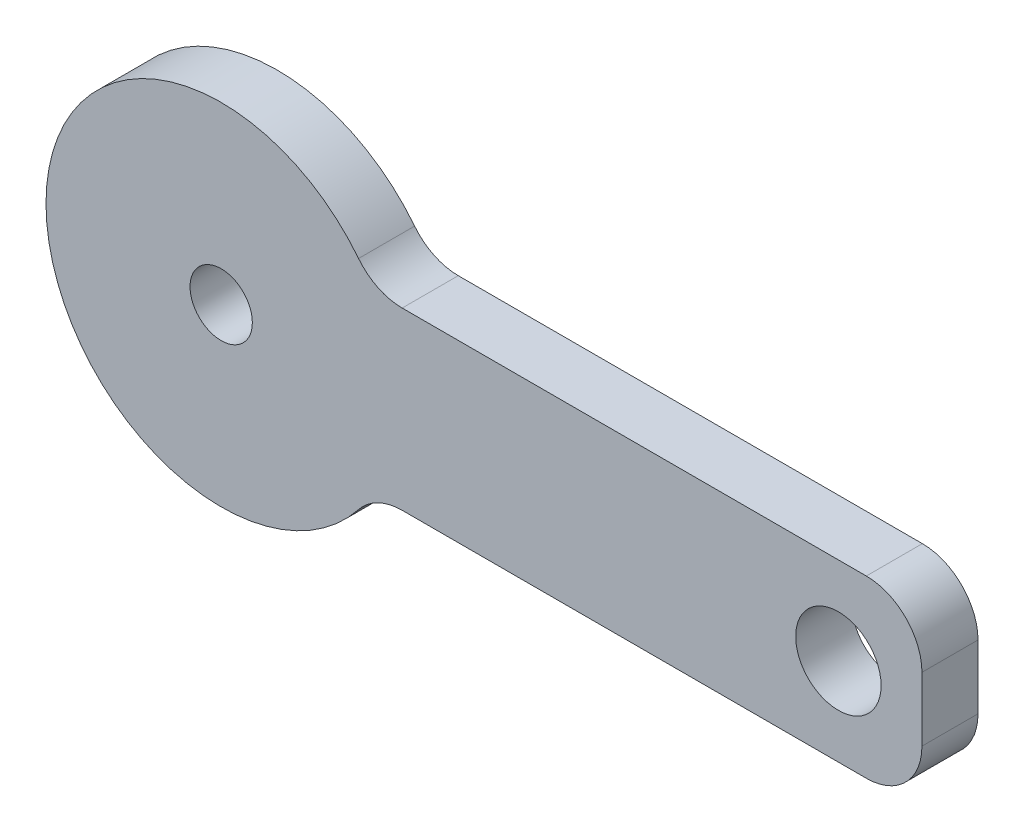
ISO-10303-21;
HEADER;
FILE_DESCRIPTION(('STEP AP214'),'2;1');
FILE_NAME('part.step','',(''),(''),'','','');
FILE_SCHEMA(('AUTOMOTIVE_DESIGN { 1 0 10303 214 1 1 1 1 }'));
ENDSEC;
DATA;
#1=APPLICATION_CONTEXT('core data for automotive mechanical design processes');
#2=APPLICATION_PROTOCOL_DEFINITION('international standard','automotive_design',2000,#1);
#3=PRODUCT_CONTEXT('',#1,'mechanical');
#4=PRODUCT('Part','Part','',(#3));
#5=PRODUCT_RELATED_PRODUCT_CATEGORY('part','',(#4));
#6=PRODUCT_DEFINITION_FORMATION('','',#4);
#7=PRODUCT_DEFINITION_CONTEXT('part definition',#1,'design');
#8=PRODUCT_DEFINITION('design','',#6,#7);
#9=PRODUCT_DEFINITION_SHAPE('','',#8);
#10=(LENGTH_UNIT() NAMED_UNIT(*) SI_UNIT(.MILLI.,.METRE.));
#11=(NAMED_UNIT(*) PLANE_ANGLE_UNIT() SI_UNIT($,.RADIAN.));
#12=(NAMED_UNIT(*) SI_UNIT($,.STERADIAN.) SOLID_ANGLE_UNIT());
#13=UNCERTAINTY_MEASURE_WITH_UNIT(LENGTH_MEASURE(1.E-05),#10,'distance_accuracy_value','');
#14=(GEOMETRIC_REPRESENTATION_CONTEXT(3) GLOBAL_UNCERTAINTY_ASSIGNED_CONTEXT((#13)) GLOBAL_UNIT_ASSIGNED_CONTEXT((#10,
#11,#12)) REPRESENTATION_CONTEXT('',''));
#15=CARTESIAN_POINT('',(0.,0.,0.));
#16=DIRECTION('',(0.,0.,1.));
#17=DIRECTION('',(1.,0.,0.));
#18=AXIS2_PLACEMENT_3D('',#15,#16,#17);
#19=CARTESIAN_POINT('',(5.16599457994296,-4.0875,1.6002));
#20=DIRECTION('',(0.,0.,-1.));
#21=DIRECTION('',(-1.,0.,0.));
#22=AXIS2_PLACEMENT_3D('',#19,#20,#21);
#23=CYLINDRICAL_SURFACE('',#22,1.5875);
#24=CARTESIAN_POINT('',(5.16599457994296,-4.0875,0.));
#25=DIRECTION('',(0.,0.,-1.));
#26=DIRECTION('',(1.,0.,0.));
#27=AXIS2_PLACEMENT_3D('',#24,#25,#26);
#28=CIRCLE('',#27,1.5875);
#29=CARTESIAN_POINT('',(3.92105850470053,-3.10246679316888,0.));
#30=VERTEX_POINT('',#29);
#31=CARTESIAN_POINT('',(5.16599457994296,-2.5,0.));
#32=VERTEX_POINT('',#31);
#33=EDGE_CURVE('E129',#30,#32,#28,.T.);
#34=ORIENTED_EDGE('',*,*,#33,.T.);
#35=DIRECTION('',(0.,0.,-1.));
#36=VECTOR('',#35,1.);
#37=CARTESIAN_POINT('',(5.16599457994296,-2.5,1.6002));
#38=LINE('',#37,#36);
#39=CARTESIAN_POINT('',(5.16599457994296,-2.5,1.6002));
#40=VERTEX_POINT('',#39);
#41=EDGE_CURVE('E11',#40,#32,#38,.T.);
#42=ORIENTED_EDGE('',*,*,#41,.F.);
#43=CARTESIAN_POINT('',(5.16599457994296,-4.0875,1.6002));
#44=DIRECTION('',(0.,0.,-1.));
#45=DIRECTION('',(1.,0.,0.));
#46=AXIS2_PLACEMENT_3D('',#43,#44,#45);
#47=CIRCLE('',#46,1.5875);
#48=CARTESIAN_POINT('',(3.92105850470053,-3.10246679316888,1.6002));
#49=VERTEX_POINT('',#48);
#50=EDGE_CURVE('E144',#49,#40,#47,.T.);
#51=ORIENTED_EDGE('',*,*,#50,.F.);
#52=DIRECTION('',(0.,0.,-1.));
#53=VECTOR('',#52,1.);
#54=CARTESIAN_POINT('',(3.92105850470053,-3.10246679316888,1.6002));
#55=LINE('',#54,#53);
#56=EDGE_CURVE('E125',#49,#30,#55,.T.);
#57=ORIENTED_EDGE('',*,*,#56,.T.);
#58=EDGE_LOOP('',(#34,#42,#51,#57));
#59=FACE_BOUND('',#58,.T.);
#60=ADVANCED_FACE('F33',(#59),#23,.F.);
#61=CARTESIAN_POINT('',(5.16599457994296,-2.5,1.6002));
#62=DIRECTION('',(0.,1.,0.));
#63=DIRECTION('',(-1.,0.,0.));
#64=AXIS2_PLACEMENT_3D('',#61,#62,#63);
#65=PLANE('',#64);
#66=DIRECTION('',(1.,0.,0.));
#67=VECTOR('',#66,1.);
#68=CARTESIAN_POINT('',(5.16599457994296,-2.5,0.));
#69=LINE('',#68,#67);
#70=CARTESIAN_POINT('',(18.4125,-2.5,0.));
#71=VERTEX_POINT('',#70);
#72=EDGE_CURVE('E132',#32,#71,#69,.T.);
#73=ORIENTED_EDGE('',*,*,#72,.T.);
#74=DIRECTION('',(0.,0.,-1.));
#75=VECTOR('',#74,1.);
#76=CARTESIAN_POINT('',(18.4125,-2.5,1.6002));
#77=LINE('',#76,#75);
#78=CARTESIAN_POINT('',(18.4125,-2.5,1.6002));
#79=VERTEX_POINT('',#78);
#80=EDGE_CURVE('E41',#79,#71,#77,.T.);
#81=ORIENTED_EDGE('',*,*,#80,.F.);
#82=DIRECTION('',(1.,0.,0.));
#83=VECTOR('',#82,1.);
#84=CARTESIAN_POINT('',(5.16599457994296,-2.5,1.6002));
#85=LINE('',#84,#83);
#86=EDGE_CURVE('E92',#40,#79,#85,.T.);
#87=ORIENTED_EDGE('',*,*,#86,.F.);
#88=ORIENTED_EDGE('',*,*,#41,.T.);
#89=EDGE_LOOP('',(#73,#81,#87,#88));
#90=FACE_BOUND('',#89,.T.);
#91=ADVANCED_FACE('F211',(#90),#65,.F.);
#92=CARTESIAN_POINT('',(18.4125,-0.9125,1.6002));
#93=DIRECTION('',(0.,0.,-1.));
#94=DIRECTION('',(-1.,0.,0.));
#95=AXIS2_PLACEMENT_3D('',#92,#93,#94);
#96=CYLINDRICAL_SURFACE('',#95,1.5875);
#97=CARTESIAN_POINT('',(18.4125,-0.9125,0.));
#98=DIRECTION('',(0.,0.,1.));
#99=DIRECTION('',(1.,0.,0.));
#100=AXIS2_PLACEMENT_3D('',#97,#98,#99);
#101=CIRCLE('',#100,1.5875);
#102=CARTESIAN_POINT('',(20.,-0.9125,0.));
#103=VERTEX_POINT('',#102);
#104=EDGE_CURVE('E135',#71,#103,#101,.T.);
#105=ORIENTED_EDGE('',*,*,#104,.T.);
#106=DIRECTION('',(0.,0.,-1.));
#107=VECTOR('',#106,1.);
#108=CARTESIAN_POINT('',(20.,-0.9125,1.6002));
#109=LINE('',#108,#107);
#110=CARTESIAN_POINT('',(20.,-0.9125,1.6002));
#111=VERTEX_POINT('',#110);
#112=EDGE_CURVE('E151',#111,#103,#109,.T.);
#113=ORIENTED_EDGE('',*,*,#112,.F.);
#114=CARTESIAN_POINT('',(18.4125,-0.9125,1.6002));
#115=DIRECTION('',(0.,0.,1.));
#116=DIRECTION('',(1.,0.,0.));
#117=AXIS2_PLACEMENT_3D('',#114,#115,#116);
#118=CIRCLE('',#117,1.5875);
#119=EDGE_CURVE('E159',#79,#111,#118,.T.);
#120=ORIENTED_EDGE('',*,*,#119,.F.);
#121=ORIENTED_EDGE('',*,*,#80,.T.);
#122=EDGE_LOOP('',(#105,#113,#120,#121));
#123=FACE_BOUND('',#122,.T.);
#124=ADVANCED_FACE('F157',(#123),#96,.T.);
#125=CARTESIAN_POINT('',(20.,-0.9125,1.6002));
#126=DIRECTION('',(-1.,0.,0.));
#127=DIRECTION('',(0.,0.,1.));
#128=AXIS2_PLACEMENT_3D('',#125,#126,#127);
#129=PLANE('',#128);
#130=DIRECTION('',(0.,1.,0.));
#131=VECTOR('',#130,1.);
#132=CARTESIAN_POINT('',(20.,-0.9125,0.));
#133=LINE('',#132,#131);
#134=CARTESIAN_POINT('',(20.,0.9125,0.));
#135=VERTEX_POINT('',#134);
#136=EDGE_CURVE('E137',#103,#135,#133,.T.);
#137=ORIENTED_EDGE('',*,*,#136,.T.);
#138=DIRECTION('',(0.,0.,-1.));
#139=VECTOR('',#138,1.);
#140=CARTESIAN_POINT('',(20.,0.9125,1.6002));
#141=LINE('',#140,#139);
#142=CARTESIAN_POINT('',(20.,0.9125,1.6002));
#143=VERTEX_POINT('',#142);
#144=EDGE_CURVE('E148',#143,#135,#141,.T.);
#145=ORIENTED_EDGE('',*,*,#144,.F.);
#146=DIRECTION('',(0.,1.,0.));
#147=VECTOR('',#146,1.);
#148=CARTESIAN_POINT('',(20.,-0.9125,1.6002));
#149=LINE('',#148,#147);
#150=EDGE_CURVE('E171',#111,#143,#149,.T.);
#151=ORIENTED_EDGE('',*,*,#150,.F.);
#152=ORIENTED_EDGE('',*,*,#112,.T.);
#153=EDGE_LOOP('',(#137,#145,#151,#152));
#154=FACE_BOUND('',#153,.T.);
#155=ADVANCED_FACE('F167',(#154),#129,.F.);
#156=CARTESIAN_POINT('',(18.4125,0.9125,1.6002));
#157=DIRECTION('',(0.,0.,-1.));
#158=DIRECTION('',(-1.,0.,0.));
#159=AXIS2_PLACEMENT_3D('',#156,#157,#158);
#160=CYLINDRICAL_SURFACE('',#159,1.5875);
#161=CARTESIAN_POINT('',(18.4125,0.9125,0.));
#162=DIRECTION('',(0.,0.,1.));
#163=DIRECTION('',(-1.,0.,0.));
#164=AXIS2_PLACEMENT_3D('',#161,#162,#163);
#165=CIRCLE('',#164,1.5875);
#166=CARTESIAN_POINT('',(18.4125,2.5,0.));
#167=VERTEX_POINT('',#166);
#168=EDGE_CURVE('E139',#135,#167,#165,.T.);
#169=ORIENTED_EDGE('',*,*,#168,.T.);
#170=DIRECTION('',(0.,0.,-1.));
#171=VECTOR('',#170,1.);
#172=CARTESIAN_POINT('',(18.4125,2.5,1.6002));
#173=LINE('',#172,#171);
#174=CARTESIAN_POINT('',(18.4125,2.5,1.6002));
#175=VERTEX_POINT('',#174);
#176=EDGE_CURVE('E120',#175,#167,#173,.T.);
#177=ORIENTED_EDGE('',*,*,#176,.F.);
#178=CARTESIAN_POINT('',(18.4125,0.9125,1.6002));
#179=DIRECTION('',(0.,0.,1.));
#180=DIRECTION('',(-1.,0.,0.));
#181=AXIS2_PLACEMENT_3D('',#178,#179,#180);
#182=CIRCLE('',#181,1.5875);
#183=EDGE_CURVE('E111',#143,#175,#182,.T.);
#184=ORIENTED_EDGE('',*,*,#183,.F.);
#185=ORIENTED_EDGE('',*,*,#144,.T.);
#186=EDGE_LOOP('',(#169,#177,#184,#185));
#187=FACE_BOUND('',#186,.T.);
#188=ADVANCED_FACE('F170',(#187),#160,.T.);
#189=CARTESIAN_POINT('',(5.16599457994296,2.5,1.6002));
#190=DIRECTION('',(0.,-1.,0.));
#191=DIRECTION('',(1.,0.,0.));
#192=AXIS2_PLACEMENT_3D('',#189,#190,#191);
#193=PLANE('',#192);
#194=DIRECTION('',(-1.,0.,0.));
#195=VECTOR('',#194,1.);
#196=CARTESIAN_POINT('',(5.16599457994296,2.5,0.));
#197=LINE('',#196,#195);
#198=CARTESIAN_POINT('',(5.16599457994296,2.5,0.));
#199=VERTEX_POINT('',#198);
#200=EDGE_CURVE('E119',#167,#199,#197,.T.);
#201=ORIENTED_EDGE('',*,*,#200,.T.);
#202=DIRECTION('',(0.,0.,-1.));
#203=VECTOR('',#202,1.);
#204=CARTESIAN_POINT('',(5.16599457994296,2.5,1.6002));
#205=LINE('',#204,#203);
#206=CARTESIAN_POINT('',(5.16599457994296,2.5,1.6002));
#207=VERTEX_POINT('',#206);
#208=EDGE_CURVE('E116',#207,#199,#205,.T.);
#209=ORIENTED_EDGE('',*,*,#208,.F.);
#210=DIRECTION('',(-1.,0.,0.));
#211=VECTOR('',#210,1.);
#212=CARTESIAN_POINT('',(5.16599457994296,2.5,1.6002));
#213=LINE('',#212,#211);
#214=EDGE_CURVE('E105',#175,#207,#213,.T.);
#215=ORIENTED_EDGE('',*,*,#214,.F.);
#216=ORIENTED_EDGE('',*,*,#176,.T.);
#217=EDGE_LOOP('',(#201,#209,#215,#216));
#218=FACE_BOUND('',#217,.T.);
#219=ADVANCED_FACE('F117',(#218),#193,.F.);
#220=CARTESIAN_POINT('',(5.16599457994296,4.0875,1.6002));
#221=DIRECTION('',(0.,0.,-1.));
#222=DIRECTION('',(-1.,0.,0.));
#223=AXIS2_PLACEMENT_3D('',#220,#221,#222);
#224=CYLINDRICAL_SURFACE('',#223,1.5875);
#225=CARTESIAN_POINT('',(5.16599457994296,4.0875,0.));
#226=DIRECTION('',(0.,0.,-1.));
#227=DIRECTION('',(-1.,0.,0.));
#228=AXIS2_PLACEMENT_3D('',#225,#226,#227);
#229=CIRCLE('',#228,1.5875);
#230=CARTESIAN_POINT('',(3.92105850470054,3.10246679316888,0.));
#231=VERTEX_POINT('',#230);
#232=EDGE_CURVE('E78',#199,#231,#229,.T.);
#233=ORIENTED_EDGE('',*,*,#232,.T.);
#234=DIRECTION('',(0.,0.,-1.));
#235=VECTOR('',#234,1.);
#236=CARTESIAN_POINT('',(3.92105850470054,3.10246679316888,1.6002));
#237=LINE('',#236,#235);
#238=CARTESIAN_POINT('',(3.92105850470054,3.10246679316888,1.6002));
#239=VERTEX_POINT('',#238);
#240=EDGE_CURVE('E121',#239,#231,#237,.T.);
#241=ORIENTED_EDGE('',*,*,#240,.F.);
#242=CARTESIAN_POINT('',(5.16599457994296,4.0875,1.6002));
#243=DIRECTION('',(0.,0.,-1.));
#244=DIRECTION('',(-1.,0.,0.));
#245=AXIS2_PLACEMENT_3D('',#242,#243,#244);
#246=CIRCLE('',#245,1.5875);
#247=EDGE_CURVE('E109',#207,#239,#246,.T.);
#248=ORIENTED_EDGE('',*,*,#247,.F.);
#249=ORIENTED_EDGE('',*,*,#208,.T.);
#250=EDGE_LOOP('',(#233,#241,#248,#249));
#251=FACE_BOUND('',#250,.T.);
#252=ADVANCED_FACE('F123',(#251),#224,.F.);
#253=CARTESIAN_POINT('',(0.,0.,1.6002));
#254=DIRECTION('',(0.,0.,-1.));
#255=DIRECTION('',(-1.,0.,0.));
#256=AXIS2_PLACEMENT_3D('',#253,#254,#255);
#257=CYLINDRICAL_SURFACE('',#256,5.);
#258=CARTESIAN_POINT('',(0.,0.,0.));
#259=DIRECTION('',(0.,0.,1.));
#260=DIRECTION('',(1.,0.,0.));
#261=AXIS2_PLACEMENT_3D('',#258,#259,#260);
#262=CIRCLE('',#261,5.);
#263=EDGE_CURVE('E84',#231,#30,#262,.T.);
#264=ORIENTED_EDGE('',*,*,#263,.T.);
#265=ORIENTED_EDGE('',*,*,#56,.F.);
#266=CARTESIAN_POINT('',(0.,0.,1.6002));
#267=DIRECTION('',(0.,0.,1.));
#268=DIRECTION('',(1.,0.,0.));
#269=AXIS2_PLACEMENT_3D('',#266,#267,#268);
#270=CIRCLE('',#269,5.);
#271=EDGE_CURVE('E49',#239,#49,#270,.T.);
#272=ORIENTED_EDGE('',*,*,#271,.F.);
#273=ORIENTED_EDGE('',*,*,#240,.T.);
#274=EDGE_LOOP('',(#264,#265,#272,#273));
#275=FACE_BOUND('',#274,.T.);
#276=ADVANCED_FACE('F193',(#275),#257,.T.);
#277=CARTESIAN_POINT('',(5.16599457994296,-4.0875,1.6002));
#278=DIRECTION('',(0.,0.,1.));
#279=DIRECTION('',(1.,0.,0.));
#280=AXIS2_PLACEMENT_3D('',#277,#278,#279);
#281=PLANE('',#280);
#282=CARTESIAN_POINT('',(17.6155947933726,0.,1.6002));
#283=DIRECTION('',(0.,0.,1.));
#284=DIRECTION('',(1.,0.,0.));
#285=AXIS2_PLACEMENT_3D('',#282,#283,#284);
#286=CIRCLE('',#285,1.2192);
#287=CARTESIAN_POINT('',(18.8347947933726,0.,1.6002));
#288=VERTEX_POINT('',#287);
#289=EDGE_CURVE('E185',#288,#288,#286,.T.);
#290=ORIENTED_EDGE('',*,*,#289,.F.);
#291=EDGE_LOOP('',(#290));
#292=FACE_BOUND('',#291,.T.);
#293=CARTESIAN_POINT('',(0.,0.,1.6002));
#294=DIRECTION('',(0.,0.,1.));
#295=DIRECTION('',(1.,0.,0.));
#296=AXIS2_PLACEMENT_3D('',#293,#294,#295);
#297=CIRCLE('',#296,0.888999999999999);
#298=CARTESIAN_POINT('',(0.888999999999999,0.,1.6002));
#299=VERTEX_POINT('',#298);
#300=EDGE_CURVE('E179',#299,#299,#297,.T.);
#301=ORIENTED_EDGE('',*,*,#300,.F.);
#302=EDGE_LOOP('',(#301));
#303=FACE_BOUND('',#302,.T.);
#304=ORIENTED_EDGE('',*,*,#50,.T.);
#305=ORIENTED_EDGE('',*,*,#86,.T.);
#306=ORIENTED_EDGE('',*,*,#119,.T.);
#307=ORIENTED_EDGE('',*,*,#150,.T.);
#308=ORIENTED_EDGE('',*,*,#183,.T.);
#309=ORIENTED_EDGE('',*,*,#214,.T.);
#310=ORIENTED_EDGE('',*,*,#247,.T.);
#311=ORIENTED_EDGE('',*,*,#271,.T.);
#312=EDGE_LOOP('',(#304,#305,#306,#307,#308,#309,#310,#311));
#313=FACE_BOUND('',#312,.T.);
#314=ADVANCED_FACE('F107',(#292,#303,#313),#281,.T.);
#315=CARTESIAN_POINT('',(5.16599457994296,-4.0875,0.));
#316=DIRECTION('',(0.,0.,1.));
#317=DIRECTION('',(1.,0.,0.));
#318=AXIS2_PLACEMENT_3D('',#315,#316,#317);
#319=PLANE('',#318);
#320=CARTESIAN_POINT('',(17.6155947933726,0.,0.));
#321=DIRECTION('',(0.,0.,1.));
#322=DIRECTION('',(1.,0.,0.));
#323=AXIS2_PLACEMENT_3D('',#320,#321,#322);
#324=CIRCLE('',#323,1.2192);
#325=CARTESIAN_POINT('',(18.8347947933726,0.,0.));
#326=VERTEX_POINT('',#325);
#327=EDGE_CURVE('E182',#326,#326,#324,.T.);
#328=ORIENTED_EDGE('',*,*,#327,.T.);
#329=EDGE_LOOP('',(#328));
#330=FACE_BOUND('',#329,.T.);
#331=CARTESIAN_POINT('',(0.,0.,0.));
#332=DIRECTION('',(0.,0.,1.));
#333=DIRECTION('',(1.,0.,0.));
#334=AXIS2_PLACEMENT_3D('',#331,#332,#333);
#335=CIRCLE('',#334,0.889);
#336=CARTESIAN_POINT('',(0.889,0.,0.));
#337=VERTEX_POINT('',#336);
#338=EDGE_CURVE('E133',#337,#337,#335,.T.);
#339=ORIENTED_EDGE('',*,*,#338,.T.);
#340=EDGE_LOOP('',(#339));
#341=FACE_BOUND('',#340,.T.);
#342=ORIENTED_EDGE('',*,*,#33,.F.);
#343=ORIENTED_EDGE('',*,*,#263,.F.);
#344=ORIENTED_EDGE('',*,*,#232,.F.);
#345=ORIENTED_EDGE('',*,*,#200,.F.);
#346=ORIENTED_EDGE('',*,*,#168,.F.);
#347=ORIENTED_EDGE('',*,*,#136,.F.);
#348=ORIENTED_EDGE('',*,*,#104,.F.);
#349=ORIENTED_EDGE('',*,*,#72,.F.);
#350=EDGE_LOOP('',(#342,#343,#344,#345,#346,#347,#348,#349));
#351=FACE_BOUND('',#350,.T.);
#352=ADVANCED_FACE('F163',(#330,#341,#351),#319,.F.);
#353=CARTESIAN_POINT('',(0.,0.,1.6002));
#354=DIRECTION('',(0.,0.,1.));
#355=DIRECTION('',(1.,0.,0.));
#356=AXIS2_PLACEMENT_3D('',#353,#354,#355);
#357=CYLINDRICAL_SURFACE('',#356,0.888999999999999);
#358=ORIENTED_EDGE('',*,*,#338,.F.);
#359=EDGE_LOOP('',(#358));
#360=FACE_BOUND('',#359,.T.);
#361=ORIENTED_EDGE('',*,*,#300,.T.);
#362=EDGE_LOOP('',(#361));
#363=FACE_BOUND('',#362,.T.);
#364=ADVANCED_FACE('F197',(#360,#363),#357,.F.);
#365=CARTESIAN_POINT('',(17.6155947933726,0.,1.6002));
#366=DIRECTION('',(0.,0.,1.));
#367=DIRECTION('',(1.,0.,0.));
#368=AXIS2_PLACEMENT_3D('',#365,#366,#367);
#369=CYLINDRICAL_SURFACE('',#368,1.2192);
#370=ORIENTED_EDGE('',*,*,#327,.F.);
#371=EDGE_LOOP('',(#370));
#372=FACE_BOUND('',#371,.T.);
#373=ORIENTED_EDGE('',*,*,#289,.T.);
#374=EDGE_LOOP('',(#373));
#375=FACE_BOUND('',#374,.T.);
#376=ADVANCED_FACE('F189',(#372,#375),#369,.F.);
#377=CLOSED_SHELL('',(#60,#91,#124,#155,#188,#219,#252,#276,#314,#352,#364,#376));
#378=MANIFOLD_SOLID_BREP('B2',#377);
#379=ADVANCED_BREP_SHAPE_REPRESENTATION('',(#18,#378),#14);
#380=SHAPE_DEFINITION_REPRESENTATION(#9,#379);
ENDSEC;
END-ISO-10303-21;
